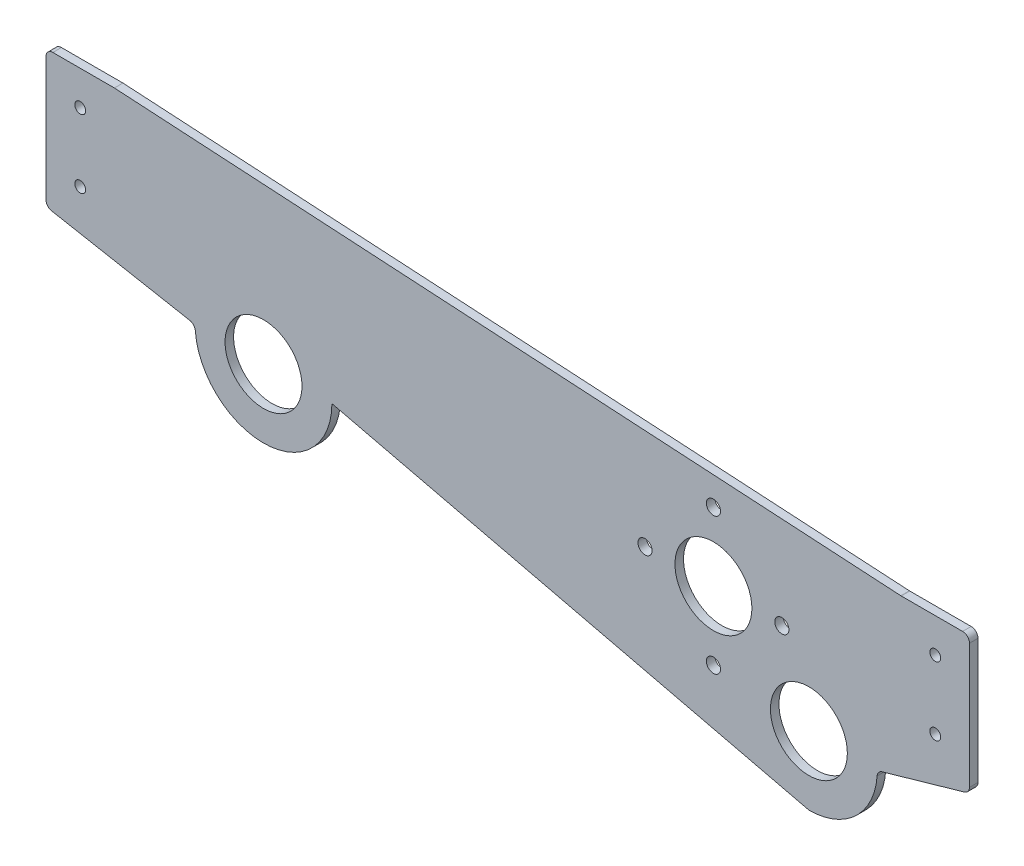
ISO-10303-21;
HEADER;
FILE_DESCRIPTION(('STEP AP214'),'2;1');
FILE_NAME('part.step','',(''),(''),'','','');
FILE_SCHEMA(('AUTOMOTIVE_DESIGN { 1 0 10303 214 1 1 1 1 }'));
ENDSEC;
DATA;
#1=APPLICATION_CONTEXT('core data for automotive mechanical design processes');
#2=APPLICATION_PROTOCOL_DEFINITION('international standard','automotive_design',2000,#1);
#3=PRODUCT_CONTEXT('',#1,'mechanical');
#4=PRODUCT('Part','Part','',(#3));
#5=PRODUCT_RELATED_PRODUCT_CATEGORY('part','',(#4));
#6=PRODUCT_DEFINITION_FORMATION('','',#4);
#7=PRODUCT_DEFINITION_CONTEXT('part definition',#1,'design');
#8=PRODUCT_DEFINITION('design','',#6,#7);
#9=PRODUCT_DEFINITION_SHAPE('','',#8);
#10=(LENGTH_UNIT() NAMED_UNIT(*) SI_UNIT(.MILLI.,.METRE.));
#11=(NAMED_UNIT(*) PLANE_ANGLE_UNIT() SI_UNIT($,.RADIAN.));
#12=(NAMED_UNIT(*) SI_UNIT($,.STERADIAN.) SOLID_ANGLE_UNIT());
#13=UNCERTAINTY_MEASURE_WITH_UNIT(LENGTH_MEASURE(1.E-05),#10,'distance_accuracy_value','');
#14=(GEOMETRIC_REPRESENTATION_CONTEXT(3) GLOBAL_UNCERTAINTY_ASSIGNED_CONTEXT((#13)) GLOBAL_UNIT_ASSIGNED_CONTEXT((#10,
#11,#12)) REPRESENTATION_CONTEXT('',''));
#15=CARTESIAN_POINT('',(0.,0.,0.));
#16=DIRECTION('',(0.,0.,1.));
#17=DIRECTION('',(1.,0.,0.));
#18=AXIS2_PLACEMENT_3D('',#15,#16,#17);
#19=CARTESIAN_POINT('',(-90.681416721827,103.131947821241,3.175));
#20=DIRECTION('',(0.,0.,-1.));
#21=DIRECTION('',(-1.,0.,0.));
#22=AXIS2_PLACEMENT_3D('',#19,#20,#21);
#23=CYLINDRICAL_SURFACE('',#22,25.4);
#24=CARTESIAN_POINT('',(-90.681416721827,103.131947821241,3.175));
#25=DIRECTION('',(0.,0.,1.));
#26=DIRECTION('',(1.,0.,0.));
#27=AXIS2_PLACEMENT_3D('',#24,#25,#26);
#28=CIRCLE('',#27,25.4);
#29=CARTESIAN_POINT('',(-116.007785817688,101.199325659454,3.175));
#30=VERTEX_POINT('',#29);
#31=CARTESIAN_POINT('',(-65.2814167218271,103.131947821241,3.175));
#32=VERTEX_POINT('',#31);
#33=EDGE_CURVE('E156',#30,#32,#28,.T.);
#34=ORIENTED_EDGE('',*,*,#33,.F.);
#35=DIRECTION('',(0.,0.,-1.));
#36=VECTOR('',#35,1.);
#37=CARTESIAN_POINT('',(-116.007785817688,101.199325659454,3.175));
#38=LINE('',#37,#36);
#39=CARTESIAN_POINT('',(-116.007785817688,101.199325659454,0.));
#40=VERTEX_POINT('',#39);
#41=EDGE_CURVE('E234',#30,#40,#38,.T.);
#42=ORIENTED_EDGE('',*,*,#41,.T.);
#43=CARTESIAN_POINT('',(-90.681416721827,103.131947821241,0.));
#44=DIRECTION('',(0.,0.,1.));
#45=DIRECTION('',(1.,0.,0.));
#46=AXIS2_PLACEMENT_3D('',#43,#44,#45);
#47=CIRCLE('',#46,25.4);
#48=CARTESIAN_POINT('',(-65.2814167218271,103.131947821241,0.));
#49=VERTEX_POINT('',#48);
#50=EDGE_CURVE('E181',#40,#49,#47,.T.);
#51=ORIENTED_EDGE('',*,*,#50,.T.);
#52=DIRECTION('',(0.,0.,-1.));
#53=VECTOR('',#52,1.);
#54=CARTESIAN_POINT('',(-65.2814167218271,103.131947821241,3.175));
#55=LINE('',#54,#53);
#56=EDGE_CURVE('E174',#32,#49,#55,.T.);
#57=ORIENTED_EDGE('',*,*,#56,.F.);
#58=EDGE_LOOP('',(#34,#42,#51,#57));
#59=FACE_BOUND('',#58,.T.);
#60=ADVANCED_FACE('F38',(#59),#23,.T.);
#61=CARTESIAN_POINT('',(19.7382826162339,82.8854057679976,3.175));
#62=DIRECTION('',(0.231661203092081,0.972796529075803,0.));
#63=DIRECTION('',(-0.972796529075803,0.231661203092081,0.));
#64=AXIS2_PLACEMENT_3D('',#61,#62,#63);
#65=PLANE('',#64);
#66=DIRECTION('',(0.972796529075803,-0.231661203092081,0.));
#67=VECTOR('',#66,1.);
#68=CARTESIAN_POINT('',(19.7382826162339,82.8854057679976,0.));
#69=LINE('',#68,#67);
#70=CARTESIAN_POINT('',(111.824894309563,60.9559532916229,0.));
#71=VERTEX_POINT('',#70);
#72=EDGE_CURVE('E341',#49,#71,#69,.T.);
#73=ORIENTED_EDGE('',*,*,#72,.T.);
#74=DIRECTION('',(0.,0.,-1.));
#75=VECTOR('',#74,1.);
#76=CARTESIAN_POINT('',(111.824894309563,60.9559532916229,3.175));
#77=LINE('',#76,#75);
#78=CARTESIAN_POINT('',(111.824894309563,60.9559532916229,3.175));
#79=VERTEX_POINT('',#78);
#80=EDGE_CURVE('E176',#79,#71,#77,.T.);
#81=ORIENTED_EDGE('',*,*,#80,.F.);
#82=DIRECTION('',(0.972796529075803,-0.231661203092081,0.));
#83=VECTOR('',#82,1.);
#84=CARTESIAN_POINT('',(19.7382826162339,82.8854057679976,3.175));
#85=LINE('',#84,#83);
#86=EDGE_CURVE('E162',#32,#79,#85,.T.);
#87=ORIENTED_EDGE('',*,*,#86,.F.);
#88=ORIENTED_EDGE('',*,*,#56,.T.);
#89=EDGE_LOOP('',(#73,#81,#87,#88));
#90=FACE_BOUND('',#89,.T.);
#91=ADVANCED_FACE('F173',(#90),#65,.F.);
#92=CARTESIAN_POINT('',(111.824894309563,86.3559532916229,3.175));
#93=DIRECTION('',(0.,0.,-1.));
#94=DIRECTION('',(-1.,0.,0.));
#95=AXIS2_PLACEMENT_3D('',#92,#93,#94);
#96=CYLINDRICAL_SURFACE('',#95,25.4);
#97=CARTESIAN_POINT('',(111.824894309563,86.3559532916229,0.));
#98=DIRECTION('',(0.,0.,1.));
#99=DIRECTION('',(1.,0.,0.));
#100=AXIS2_PLACEMENT_3D('',#97,#98,#99);
#101=CIRCLE('',#100,25.4);
#102=CARTESIAN_POINT('',(137.164009765819,84.5983333399428,0.));
#103=VERTEX_POINT('',#102);
#104=EDGE_CURVE('E344',#71,#103,#101,.T.);
#105=ORIENTED_EDGE('',*,*,#104,.T.);
#106=DIRECTION('',(0.,0.,-1.));
#107=VECTOR('',#106,1.);
#108=CARTESIAN_POINT('',(137.164009765819,84.5983333399428,3.175));
#109=LINE('',#108,#107);
#110=CARTESIAN_POINT('',(137.164009765819,84.5983333399428,3.175));
#111=VERTEX_POINT('',#110);
#112=EDGE_CURVE('E232',#103,#111,#109,.F.);
#113=ORIENTED_EDGE('',*,*,#112,.T.);
#114=CARTESIAN_POINT('',(111.824894309563,86.3559532916229,3.175));
#115=DIRECTION('',(0.,0.,1.));
#116=DIRECTION('',(1.,0.,0.));
#117=AXIS2_PLACEMENT_3D('',#114,#115,#116);
#118=CIRCLE('',#117,25.4);
#119=EDGE_CURVE('E178',#79,#111,#118,.T.);
#120=ORIENTED_EDGE('',*,*,#119,.F.);
#121=ORIENTED_EDGE('',*,*,#80,.T.);
#122=EDGE_LOOP('',(#105,#113,#120,#121));
#123=FACE_BOUND('',#122,.T.);
#124=ADVANCED_FACE('F272',(#123),#96,.T.);
#125=CARTESIAN_POINT('',(-12.4550081915659,43.4486341080888,3.175));
#126=DIRECTION('',(-0.27556197601449,0.961283307550375,0.));
#127=DIRECTION('',(-0.961283307550375,-0.27556197601449,0.));
#128=AXIS2_PLACEMENT_3D('',#125,#126,#127);
#129=PLANE('',#128);
#130=DIRECTION('',(0.961283307550375,0.27556197601449,0.));
#131=VECTOR('',#130,1.);
#132=CARTESIAN_POINT('',(-12.4550081915659,43.4486341080888,0.));
#133=LINE('',#132,#131);
#134=CARTESIAN_POINT('',(138.997993892368,86.8642309459527,0.));
#135=VERTEX_POINT('',#134);
#136=CARTESIAN_POINT('',(169.609927419077,95.6394638309803,0.));
#137=VERTEX_POINT('',#136);
#138=EDGE_CURVE('E347',#135,#137,#133,.T.);
#139=ORIENTED_EDGE('',*,*,#138,.T.);
#140=DIRECTION('',(0.,0.,-1.));
#141=VECTOR('',#140,1.);
#142=CARTESIAN_POINT('',(169.609927419077,95.6394638309803,3.175));
#143=LINE('',#142,#141);
#144=CARTESIAN_POINT('',(169.609927419077,95.6394638309803,3.175));
#145=VERTEX_POINT('',#144);
#146=EDGE_CURVE('E223',#137,#145,#143,.F.);
#147=ORIENTED_EDGE('',*,*,#146,.T.);
#148=DIRECTION('',(0.961283307550375,0.27556197601449,0.));
#149=VECTOR('',#148,1.);
#150=CARTESIAN_POINT('',(-12.4550081915659,43.4486341080888,3.175));
#151=LINE('',#150,#149);
#152=CARTESIAN_POINT('',(138.997993892368,86.8642309459527,3.175));
#153=VERTEX_POINT('',#152);
#154=EDGE_CURVE('E424',#153,#145,#151,.T.);
#155=ORIENTED_EDGE('',*,*,#154,.F.);
#156=DIRECTION('',(0.,0.,1.));
#157=VECTOR('',#156,1.);
#158=CARTESIAN_POINT('',(138.997993892368,86.8642309459527,0.));
#159=LINE('',#158,#157);
#160=EDGE_CURVE('E220',#153,#135,#159,.F.);
#161=ORIENTED_EDGE('',*,*,#160,.T.);
#162=EDGE_LOOP('',(#139,#147,#155,#161));
#163=FACE_BOUND('',#162,.T.);
#164=ADVANCED_FACE('F410',(#163),#129,.F.);
#165=CARTESIAN_POINT('',(171.45,0.,3.175));
#166=DIRECTION('',(-1.,0.,0.));
#167=DIRECTION('',(0.,0.,1.));
#168=AXIS2_PLACEMENT_3D('',#165,#166,#167);
#169=PLANE('',#168);
#170=DIRECTION('',(0.,1.,0.));
#171=VECTOR('',#170,1.);
#172=CARTESIAN_POINT('',(171.45,0.,0.));
#173=LINE('',#172,#171);
#174=CARTESIAN_POINT('',(171.45,98.0811234321583,0.));
#175=VERTEX_POINT('',#174);
#176=CARTESIAN_POINT('',(171.45,144.42694,0.));
#177=VERTEX_POINT('',#176);
#178=EDGE_CURVE('E350',#175,#177,#173,.T.);
#179=ORIENTED_EDGE('',*,*,#178,.T.);
#180=DIRECTION('',(0.,0.,-1.));
#181=VECTOR('',#180,1.);
#182=CARTESIAN_POINT('',(171.45,144.42694,3.175));
#183=LINE('',#182,#181);
#184=CARTESIAN_POINT('',(171.45,144.42694,3.175));
#185=VERTEX_POINT('',#184);
#186=EDGE_CURVE('E218',#177,#185,#183,.F.);
#187=ORIENTED_EDGE('',*,*,#186,.T.);
#188=DIRECTION('',(0.,1.,0.));
#189=VECTOR('',#188,1.);
#190=CARTESIAN_POINT('',(171.45,0.,3.175));
#191=LINE('',#190,#189);
#192=CARTESIAN_POINT('',(171.45,98.0811234321583,3.175));
#193=VERTEX_POINT('',#192);
#194=EDGE_CURVE('E314',#193,#185,#191,.T.);
#195=ORIENTED_EDGE('',*,*,#194,.F.);
#196=DIRECTION('',(0.,0.,-1.));
#197=VECTOR('',#196,1.);
#198=CARTESIAN_POINT('',(171.45,98.0811234321583,3.175));
#199=LINE('',#198,#197);
#200=EDGE_CURVE('E215',#193,#175,#199,.T.);
#201=ORIENTED_EDGE('',*,*,#200,.T.);
#202=EDGE_LOOP('',(#179,#187,#195,#201));
#203=FACE_BOUND('',#202,.T.);
#204=ADVANCED_FACE('F406',(#203),#169,.F.);
#205=CARTESIAN_POINT('',(0.,146.96694,3.175));
#206=DIRECTION('',(0.,1.,0.));
#207=DIRECTION('',(0.,0.,1.));
#208=AXIS2_PLACEMENT_3D('',#205,#206,#207);
#209=PLANE('',#208);
#210=DIRECTION('',(1.,0.,0.));
#211=VECTOR('',#210,1.);
#212=CARTESIAN_POINT('',(0.,146.96694,3.175));
#213=LINE('',#212,#211);
#214=CARTESIAN_POINT('',(146.125030125413,146.96694,3.175));
#215=VERTEX_POINT('',#214);
#216=CARTESIAN_POINT('',(168.91,146.96694,3.175));
#217=VERTEX_POINT('',#216);
#218=EDGE_CURVE('E304',#215,#217,#213,.T.);
#219=ORIENTED_EDGE('',*,*,#218,.T.);
#220=DIRECTION('',(0.,0.,-1.));
#221=VECTOR('',#220,1.);
#222=CARTESIAN_POINT('',(168.91,146.96694,0.));
#223=LINE('',#222,#221);
#224=CARTESIAN_POINT('',(168.91,146.96694,0.));
#225=VERTEX_POINT('',#224);
#226=EDGE_CURVE('E212',#217,#225,#223,.T.);
#227=ORIENTED_EDGE('',*,*,#226,.T.);
#228=DIRECTION('',(1.,0.,0.));
#229=VECTOR('',#228,1.);
#230=CARTESIAN_POINT('',(0.,146.96694,0.));
#231=LINE('',#230,#229);
#232=CARTESIAN_POINT('',(146.125030125413,146.96694,0.));
#233=VERTEX_POINT('',#232);
#234=EDGE_CURVE('E353',#233,#225,#231,.T.);
#235=ORIENTED_EDGE('',*,*,#234,.F.);
#236=DIRECTION('',(0.,0.,-1.));
#237=VECTOR('',#236,1.);
#238=CARTESIAN_POINT('',(146.125030125413,146.96694,3.175));
#239=LINE('',#238,#237);
#240=EDGE_CURVE('E210',#233,#215,#239,.F.);
#241=ORIENTED_EDGE('',*,*,#240,.T.);
#242=EDGE_LOOP('',(#219,#227,#235,#241));
#243=FACE_BOUND('',#242,.T.);
#244=ADVANCED_FACE('F403',(#243),#209,.T.);
#245=CARTESIAN_POINT('',(9.16881158655861,155.060784184447,3.175));
#246=DIRECTION('',(0.0590273329964298,0.998256366851386,0.));
#247=DIRECTION('',(-0.998256366851386,0.0590273329964298,0.));
#248=AXIS2_PLACEMENT_3D('',#245,#246,#247);
#249=PLANE('',#248);
#250=DIRECTION('',(0.998256366851386,-0.0590273329964298,0.));
#251=VECTOR('',#250,1.);
#252=CARTESIAN_POINT('',(9.16881158655861,155.060784184447,3.175));
#253=LINE('',#252,#251);
#254=CARTESIAN_POINT('',(-146.05,164.23894,3.175));
#255=VERTEX_POINT('',#254);
#256=CARTESIAN_POINT('',(145.975100699602,146.971368828197,3.175));
#257=VERTEX_POINT('',#256);
#258=EDGE_CURVE('E302',#255,#257,#253,.T.);
#259=ORIENTED_EDGE('',*,*,#258,.T.);
#260=DIRECTION('',(0.,0.,-1.));
#261=VECTOR('',#260,1.);
#262=CARTESIAN_POINT('',(145.975100699602,146.971368828197,0.));
#263=LINE('',#262,#261);
#264=CARTESIAN_POINT('',(145.975100699602,146.971368828197,0.));
#265=VERTEX_POINT('',#264);
#266=EDGE_CURVE('E229',#257,#265,#263,.T.);
#267=ORIENTED_EDGE('',*,*,#266,.T.);
#268=DIRECTION('',(0.998256366851386,-0.0590273329964298,0.));
#269=VECTOR('',#268,1.);
#270=CARTESIAN_POINT('',(9.16881158655861,155.060784184447,0.));
#271=LINE('',#270,#269);
#272=CARTESIAN_POINT('',(-146.05,164.23894,0.));
#273=VERTEX_POINT('',#272);
#274=EDGE_CURVE('E356',#273,#265,#271,.T.);
#275=ORIENTED_EDGE('',*,*,#274,.F.);
#276=DIRECTION('',(0.,0.,-1.));
#277=VECTOR('',#276,1.);
#278=CARTESIAN_POINT('',(-146.05,164.23894,3.175));
#279=LINE('',#278,#277);
#280=EDGE_CURVE('E187',#255,#273,#279,.T.);
#281=ORIENTED_EDGE('',*,*,#280,.F.);
#282=EDGE_LOOP('',(#259,#267,#275,#281));
#283=FACE_BOUND('',#282,.T.);
#284=ADVANCED_FACE('F306',(#283),#249,.T.);
#285=CARTESIAN_POINT('',(0.,164.23894,3.175));
#286=DIRECTION('',(0.,-1.,0.));
#287=DIRECTION('',(0.,0.,-1.));
#288=AXIS2_PLACEMENT_3D('',#285,#286,#287);
#289=PLANE('',#288);
#290=DIRECTION('',(-1.,0.,0.));
#291=VECTOR('',#290,1.);
#292=CARTESIAN_POINT('',(0.,164.23894,0.));
#293=LINE('',#292,#291);
#294=CARTESIAN_POINT('',(-168.91,164.23894,0.));
#295=VERTEX_POINT('',#294);
#296=EDGE_CURVE('E358',#273,#295,#293,.T.);
#297=ORIENTED_EDGE('',*,*,#296,.T.);
#298=DIRECTION('',(0.,0.,-1.));
#299=VECTOR('',#298,1.);
#300=CARTESIAN_POINT('',(-168.91,164.23894,3.175));
#301=LINE('',#300,#299);
#302=CARTESIAN_POINT('',(-168.91,164.23894,3.175));
#303=VERTEX_POINT('',#302);
#304=EDGE_CURVE('E201',#295,#303,#301,.F.);
#305=ORIENTED_EDGE('',*,*,#304,.T.);
#306=DIRECTION('',(-1.,0.,0.));
#307=VECTOR('',#306,1.);
#308=CARTESIAN_POINT('',(0.,164.23894,3.175));
#309=LINE('',#308,#307);
#310=EDGE_CURVE('E310',#255,#303,#309,.T.);
#311=ORIENTED_EDGE('',*,*,#310,.F.);
#312=ORIENTED_EDGE('',*,*,#280,.T.);
#313=EDGE_LOOP('',(#297,#305,#311,#312));
#314=FACE_BOUND('',#313,.T.);
#315=ADVANCED_FACE('F379',(#314),#289,.F.);
#316=CARTESIAN_POINT('',(-171.45,0.,3.175));
#317=DIRECTION('',(-1.,0.,0.));
#318=DIRECTION('',(0.,0.,1.));
#319=AXIS2_PLACEMENT_3D('',#316,#317,#318);
#320=PLANE('',#319);
#321=DIRECTION('',(0.,1.,0.));
#322=VECTOR('',#321,1.);
#323=CARTESIAN_POINT('',(-171.45,0.,3.175));
#324=LINE('',#323,#322);
#325=CARTESIAN_POINT('',(-171.45,115.549747155126,3.175));
#326=VERTEX_POINT('',#325);
#327=CARTESIAN_POINT('',(-171.45,161.69894,3.175));
#328=VERTEX_POINT('',#327);
#329=EDGE_CURVE('E312',#326,#328,#324,.T.);
#330=ORIENTED_EDGE('',*,*,#329,.T.);
#331=DIRECTION('',(0.,0.,-1.));
#332=VECTOR('',#331,1.);
#333=CARTESIAN_POINT('',(-171.45,161.69894,0.));
#334=LINE('',#333,#332);
#335=CARTESIAN_POINT('',(-171.45,161.69894,0.));
#336=VERTEX_POINT('',#335);
#337=EDGE_CURVE('E185',#328,#336,#334,.T.);
#338=ORIENTED_EDGE('',*,*,#337,.T.);
#339=DIRECTION('',(0.,1.,0.));
#340=VECTOR('',#339,1.);
#341=CARTESIAN_POINT('',(-171.45,0.,0.));
#342=LINE('',#341,#340);
#343=CARTESIAN_POINT('',(-171.45,115.549747155126,0.));
#344=VERTEX_POINT('',#343);
#345=EDGE_CURVE('E253',#344,#336,#342,.T.);
#346=ORIENTED_EDGE('',*,*,#345,.F.);
#347=DIRECTION('',(0.,0.,-1.));
#348=VECTOR('',#347,1.);
#349=CARTESIAN_POINT('',(-171.45,115.549747155126,3.175));
#350=LINE('',#349,#348);
#351=EDGE_CURVE('E183',#344,#326,#350,.F.);
#352=ORIENTED_EDGE('',*,*,#351,.T.);
#353=EDGE_LOOP('',(#330,#338,#346,#352));
#354=FACE_BOUND('',#353,.T.);
#355=ADVANCED_FACE('F385',(#354),#320,.T.);
#356=CARTESIAN_POINT('',(158.75,108.86694,3.175));
#357=DIRECTION('',(0.,0.,-1.));
#358=DIRECTION('',(-1.,0.,0.));
#359=AXIS2_PLACEMENT_3D('',#356,#357,#358);
#360=CYLINDRICAL_SURFACE('',#359,2.01930000000001);
#361=CARTESIAN_POINT('',(158.75,108.86694,3.175));
#362=DIRECTION('',(0.,0.,1.));
#363=DIRECTION('',(1.,0.,0.));
#364=AXIS2_PLACEMENT_3D('',#361,#362,#363);
#365=CIRCLE('',#364,2.01930000000001);
#366=CARTESIAN_POINT('',(160.7693,108.86694,3.175));
#367=VERTEX_POINT('',#366);
#368=EDGE_CURVE('E334',#367,#367,#365,.T.);
#369=ORIENTED_EDGE('',*,*,#368,.T.);
#370=EDGE_LOOP('',(#369));
#371=FACE_BOUND('',#370,.T.);
#372=CARTESIAN_POINT('',(158.75,108.86694,0.));
#373=DIRECTION('',(0.,0.,1.));
#374=DIRECTION('',(1.,0.,0.));
#375=AXIS2_PLACEMENT_3D('',#372,#373,#374);
#376=CIRCLE('',#375,2.01930000000001);
#377=CARTESIAN_POINT('',(160.7693,108.86694,0.));
#378=VERTEX_POINT('',#377);
#379=EDGE_CURVE('E373',#378,#378,#376,.T.);
#380=ORIENTED_EDGE('',*,*,#379,.F.);
#381=EDGE_LOOP('',(#380));
#382=FACE_BOUND('',#381,.T.);
#383=ADVANCED_FACE('F388',(#371,#382),#360,.F.);
#384=CARTESIAN_POINT('',(158.75,134.26694,3.175));
#385=DIRECTION('',(0.,0.,-1.));
#386=DIRECTION('',(-1.,0.,0.));
#387=AXIS2_PLACEMENT_3D('',#384,#385,#386);
#388=CYLINDRICAL_SURFACE('',#387,2.0193);
#389=CARTESIAN_POINT('',(158.75,134.26694,3.175));
#390=DIRECTION('',(0.,0.,1.));
#391=DIRECTION('',(1.,0.,0.));
#392=AXIS2_PLACEMENT_3D('',#389,#390,#391);
#393=CIRCLE('',#392,2.0193);
#394=CARTESIAN_POINT('',(160.7693,134.26694,3.175));
#395=VERTEX_POINT('',#394);
#396=EDGE_CURVE('E331',#395,#395,#393,.T.);
#397=ORIENTED_EDGE('',*,*,#396,.T.);
#398=EDGE_LOOP('',(#397));
#399=FACE_BOUND('',#398,.T.);
#400=CARTESIAN_POINT('',(158.75,134.26694,0.));
#401=DIRECTION('',(0.,0.,1.));
#402=DIRECTION('',(1.,0.,0.));
#403=AXIS2_PLACEMENT_3D('',#400,#401,#402);
#404=CIRCLE('',#403,2.0193);
#405=CARTESIAN_POINT('',(160.7693,134.26694,0.));
#406=VERTEX_POINT('',#405);
#407=EDGE_CURVE('E370',#406,#406,#404,.T.);
#408=ORIENTED_EDGE('',*,*,#407,.F.);
#409=EDGE_LOOP('',(#408));
#410=FACE_BOUND('',#409,.T.);
#411=ADVANCED_FACE('F394',(#399,#410),#388,.F.);
#412=CARTESIAN_POINT('',(-158.75,151.53894,3.175));
#413=DIRECTION('',(0.,0.,-1.));
#414=DIRECTION('',(-1.,0.,0.));
#415=AXIS2_PLACEMENT_3D('',#412,#413,#414);
#416=CYLINDRICAL_SURFACE('',#415,2.0193);
#417=CARTESIAN_POINT('',(-158.75,151.53894,3.175));
#418=DIRECTION('',(0.,0.,1.));
#419=DIRECTION('',(1.,0.,0.));
#420=AXIS2_PLACEMENT_3D('',#417,#418,#419);
#421=CIRCLE('',#420,2.0193);
#422=CARTESIAN_POINT('',(-156.7307,151.53894,3.175));
#423=VERTEX_POINT('',#422);
#424=EDGE_CURVE('E328',#423,#423,#421,.T.);
#425=ORIENTED_EDGE('',*,*,#424,.T.);
#426=EDGE_LOOP('',(#425));
#427=FACE_BOUND('',#426,.T.);
#428=CARTESIAN_POINT('',(-158.75,151.53894,0.));
#429=DIRECTION('',(0.,0.,1.));
#430=DIRECTION('',(1.,0.,0.));
#431=AXIS2_PLACEMENT_3D('',#428,#429,#430);
#432=CIRCLE('',#431,2.0193);
#433=CARTESIAN_POINT('',(-156.7307,151.53894,0.));
#434=VERTEX_POINT('',#433);
#435=EDGE_CURVE('E367',#434,#434,#432,.T.);
#436=ORIENTED_EDGE('',*,*,#435,.F.);
#437=EDGE_LOOP('',(#436));
#438=FACE_BOUND('',#437,.T.);
#439=ADVANCED_FACE('F503',(#427,#438),#416,.F.);
#440=CARTESIAN_POINT('',(111.824894309563,86.3559532916229,3.175));
#441=DIRECTION('',(0.,0.,-1.));
#442=DIRECTION('',(-1.,0.,0.));
#443=AXIS2_PLACEMENT_3D('',#440,#441,#442);
#444=CYLINDRICAL_SURFACE('',#443,14.2875);
#445=CARTESIAN_POINT('',(111.824894309563,86.3559532916229,3.175));
#446=DIRECTION('',(0.,0.,1.));
#447=DIRECTION('',(1.,0.,0.));
#448=AXIS2_PLACEMENT_3D('',#445,#446,#447);
#449=CIRCLE('',#448,14.2875);
#450=CARTESIAN_POINT('',(126.112394309563,86.3559532916229,3.175));
#451=VERTEX_POINT('',#450);
#452=EDGE_CURVE('E325',#451,#451,#449,.T.);
#453=ORIENTED_EDGE('',*,*,#452,.T.);
#454=EDGE_LOOP('',(#453));
#455=FACE_BOUND('',#454,.T.);
#456=CARTESIAN_POINT('',(111.824894309563,86.3559532916229,0.));
#457=DIRECTION('',(0.,0.,1.));
#458=DIRECTION('',(1.,0.,0.));
#459=AXIS2_PLACEMENT_3D('',#456,#457,#458);
#460=CIRCLE('',#459,14.2875);
#461=CARTESIAN_POINT('',(126.112394309563,86.3559532916229,0.));
#462=VERTEX_POINT('',#461);
#463=EDGE_CURVE('E364',#462,#462,#460,.T.);
#464=ORIENTED_EDGE('',*,*,#463,.F.);
#465=EDGE_LOOP('',(#464));
#466=FACE_BOUND('',#465,.T.);
#467=ADVANCED_FACE('F507',(#455,#466),#444,.F.);
#468=CARTESIAN_POINT('',(-90.681416721827,103.131947821241,3.175));
#469=DIRECTION('',(0.,0.,-1.));
#470=DIRECTION('',(-1.,0.,0.));
#471=AXIS2_PLACEMENT_3D('',#468,#469,#470);
#472=CYLINDRICAL_SURFACE('',#471,14.2875);
#473=CARTESIAN_POINT('',(-90.681416721827,103.131947821241,3.175));
#474=DIRECTION('',(0.,0.,1.));
#475=DIRECTION('',(1.,0.,0.));
#476=AXIS2_PLACEMENT_3D('',#473,#474,#475);
#477=CIRCLE('',#476,14.2875);
#478=CARTESIAN_POINT('',(-76.393916721827,103.131947821241,3.175));
#479=VERTEX_POINT('',#478);
#480=EDGE_CURVE('E322',#479,#479,#477,.T.);
#481=ORIENTED_EDGE('',*,*,#480,.T.);
#482=EDGE_LOOP('',(#481));
#483=FACE_BOUND('',#482,.T.);
#484=CARTESIAN_POINT('',(-90.681416721827,103.131947821241,0.));
#485=DIRECTION('',(0.,0.,1.));
#486=DIRECTION('',(1.,0.,0.));
#487=AXIS2_PLACEMENT_3D('',#484,#485,#486);
#488=CIRCLE('',#487,14.2875);
#489=CARTESIAN_POINT('',(-76.393916721827,103.131947821241,0.));
#490=VERTEX_POINT('',#489);
#491=EDGE_CURVE('E252',#490,#490,#488,.T.);
#492=ORIENTED_EDGE('',*,*,#491,.F.);
#493=EDGE_LOOP('',(#492));
#494=FACE_BOUND('',#493,.T.);
#495=ADVANCED_FACE('F510',(#483,#494),#472,.F.);
#496=CARTESIAN_POINT('',(14.6674536846778,78.7927376613752,3.175));
#497=DIRECTION('',(0.183008489971372,0.983111332758604,0.));
#498=DIRECTION('',(-0.983111332758604,0.183008489971372,0.));
#499=AXIS2_PLACEMENT_3D('',#496,#497,#498);
#500=PLANE('',#499);
#501=DIRECTION('',(0.983111332758604,-0.183008489971372,0.));
#502=VECTOR('',#501,1.);
#503=CARTESIAN_POINT('',(14.6674536846778,78.7927376613752,3.175));
#504=LINE('',#503,#502);
#505=CARTESIAN_POINT('',(-169.374841564527,113.05264436992,3.175));
#506=VERTEX_POINT('',#505);
#507=CARTESIAN_POINT('',(-118.075581162747,103.503166228482,3.175));
#508=VERTEX_POINT('',#507);
#509=EDGE_CURVE('E320',#506,#508,#504,.T.);
#510=ORIENTED_EDGE('',*,*,#509,.F.);
#511=DIRECTION('',(0.,0.,-1.));
#512=VECTOR('',#511,1.);
#513=CARTESIAN_POINT('',(-169.374841564527,113.05264436992,0.));
#514=LINE('',#513,#512);
#515=CARTESIAN_POINT('',(-169.374841564527,113.05264436992,0.));
#516=VERTEX_POINT('',#515);
#517=EDGE_CURVE('E226',#506,#516,#514,.T.);
#518=ORIENTED_EDGE('',*,*,#517,.T.);
#519=DIRECTION('',(0.983111332758604,-0.183008489971372,0.));
#520=VECTOR('',#519,1.);
#521=CARTESIAN_POINT('',(14.6674536846778,78.7927376613752,0.));
#522=LINE('',#521,#520);
#523=CARTESIAN_POINT('',(-118.075581162747,103.503166228482,0.));
#524=VERTEX_POINT('',#523);
#525=EDGE_CURVE('E248',#516,#524,#522,.T.);
#526=ORIENTED_EDGE('',*,*,#525,.T.);
#527=DIRECTION('',(0.,0.,1.));
#528=VECTOR('',#527,1.);
#529=CARTESIAN_POINT('',(-118.075581162747,103.503166228482,3.175));
#530=LINE('',#529,#528);
#531=EDGE_CURVE('E53',#524,#508,#530,.T.);
#532=ORIENTED_EDGE('',*,*,#531,.T.);
#533=EDGE_LOOP('',(#510,#518,#526,#532));
#534=FACE_BOUND('',#533,.T.);
#535=ADVANCED_FACE('F250',(#534),#500,.F.);
#536=CARTESIAN_POINT('',(-158.75,126.13894,3.175));
#537=DIRECTION('',(0.,0.,-1.));
#538=DIRECTION('',(-1.,0.,0.));
#539=AXIS2_PLACEMENT_3D('',#536,#537,#538);
#540=CYLINDRICAL_SURFACE('',#539,2.0193);
#541=CARTESIAN_POINT('',(-158.75,126.13894,3.175));
#542=DIRECTION('',(0.,0.,1.));
#543=DIRECTION('',(1.,0.,0.));
#544=AXIS2_PLACEMENT_3D('',#541,#542,#543);
#545=CIRCLE('',#544,2.0193);
#546=CARTESIAN_POINT('',(-156.7307,126.13894,3.175));
#547=VERTEX_POINT('',#546);
#548=EDGE_CURVE('E337',#547,#547,#545,.T.);
#549=ORIENTED_EDGE('',*,*,#548,.T.);
#550=EDGE_LOOP('',(#549));
#551=FACE_BOUND('',#550,.T.);
#552=CARTESIAN_POINT('',(-158.75,126.13894,0.));
#553=DIRECTION('',(0.,0.,1.));
#554=DIRECTION('',(1.,0.,0.));
#555=AXIS2_PLACEMENT_3D('',#552,#553,#554);
#556=CIRCLE('',#555,2.0193);
#557=CARTESIAN_POINT('',(-156.7307,126.13894,0.));
#558=VERTEX_POINT('',#557);
#559=EDGE_CURVE('E169',#558,#558,#556,.T.);
#560=ORIENTED_EDGE('',*,*,#559,.F.);
#561=EDGE_LOOP('',(#560));
#562=FACE_BOUND('',#561,.T.);
#563=ADVANCED_FACE('F473',(#551,#562),#540,.F.);
#564=CARTESIAN_POINT('',(0.,0.,3.175));
#565=DIRECTION('',(0.,0.,1.));
#566=DIRECTION('',(1.,0.,0.));
#567=AXIS2_PLACEMENT_3D('',#564,#565,#566);
#568=PLANE('',#567);
#569=CARTESIAN_POINT('',(76.3807095821955,140.635499150452,3.175));
#570=DIRECTION('',(0.,0.,1.));
#571=DIRECTION('',(1.,0.,0.));
#572=AXIS2_PLACEMENT_3D('',#569,#570,#571);
#573=CIRCLE('',#572,2.62890000000001);
#574=CARTESIAN_POINT('',(79.0096095821955,140.635499150452,3.175));
#575=VERTEX_POINT('',#574);
#576=EDGE_CURVE('E445',#575,#575,#573,.T.);
#577=ORIENTED_EDGE('',*,*,#576,.F.);
#578=EDGE_LOOP('',(#577));
#579=FACE_BOUND('',#578,.T.);
#580=CARTESIAN_POINT('',(101.780709582196,115.235499150452,3.175));
#581=DIRECTION('',(0.,0.,1.));
#582=DIRECTION('',(1.,0.,0.));
#583=AXIS2_PLACEMENT_3D('',#580,#581,#582);
#584=CIRCLE('',#583,2.62890000000002);
#585=CARTESIAN_POINT('',(104.409609582196,115.235499150452,3.175));
#586=VERTEX_POINT('',#585);
#587=EDGE_CURVE('E438',#586,#586,#584,.T.);
#588=ORIENTED_EDGE('',*,*,#587,.F.);
#589=EDGE_LOOP('',(#588));
#590=FACE_BOUND('',#589,.T.);
#591=CARTESIAN_POINT('',(76.380709582196,89.8354991504521,3.175));
#592=DIRECTION('',(0.,0.,1.));
#593=DIRECTION('',(1.,0.,0.));
#594=AXIS2_PLACEMENT_3D('',#591,#592,#593);
#595=CIRCLE('',#594,2.6289);
#596=CARTESIAN_POINT('',(79.009609582196,89.8354991504521,3.175));
#597=VERTEX_POINT('',#596);
#598=EDGE_CURVE('E456',#597,#597,#595,.T.);
#599=ORIENTED_EDGE('',*,*,#598,.F.);
#600=EDGE_LOOP('',(#599));
#601=FACE_BOUND('',#600,.T.);
#602=CARTESIAN_POINT('',(50.9807095821958,115.235499150452,3.175));
#603=DIRECTION('',(0.,0.,1.));
#604=DIRECTION('',(1.,0.,0.));
#605=AXIS2_PLACEMENT_3D('',#602,#603,#604);
#606=CIRCLE('',#605,2.62890000000001);
#607=CARTESIAN_POINT('',(53.6096095821958,115.235499150452,3.175));
#608=VERTEX_POINT('',#607);
#609=EDGE_CURVE('E450',#608,#608,#606,.T.);
#610=ORIENTED_EDGE('',*,*,#609,.F.);
#611=EDGE_LOOP('',(#610));
#612=FACE_BOUND('',#611,.T.);
#613=CARTESIAN_POINT('',(76.3807095821955,115.235499150452,3.175));
#614=DIRECTION('',(0.,0.,1.));
#615=DIRECTION('',(1.,0.,0.));
#616=AXIS2_PLACEMENT_3D('',#613,#614,#615);
#617=CIRCLE('',#616,14.2875);
#618=CARTESIAN_POINT('',(90.6682095821954,115.235499150452,3.175));
#619=VERTEX_POINT('',#618);
#620=EDGE_CURVE('E432',#619,#619,#617,.T.);
#621=ORIENTED_EDGE('',*,*,#620,.F.);
#622=EDGE_LOOP('',(#621));
#623=FACE_BOUND('',#622,.T.);
#624=ORIENTED_EDGE('',*,*,#310,.T.);
#625=CARTESIAN_POINT('',(-168.91,161.69894,3.175));
#626=DIRECTION('',(0.,0.,1.));
#627=DIRECTION('',(1.,0.,0.));
#628=AXIS2_PLACEMENT_3D('',#625,#626,#627);
#629=CIRCLE('',#628,2.54);
#630=EDGE_CURVE('E208',#303,#328,#629,.T.);
#631=ORIENTED_EDGE('',*,*,#630,.T.);
#632=ORIENTED_EDGE('',*,*,#329,.F.);
#633=CARTESIAN_POINT('',(-168.91,115.549747155126,3.175));
#634=DIRECTION('',(0.,0.,1.));
#635=DIRECTION('',(1.,0.,0.));
#636=AXIS2_PLACEMENT_3D('',#633,#634,#635);
#637=CIRCLE('',#636,2.54);
#638=EDGE_CURVE('E60',#326,#506,#637,.T.);
#639=ORIENTED_EDGE('',*,*,#638,.T.);
#640=ORIENTED_EDGE('',*,*,#509,.T.);
#641=CARTESIAN_POINT('',(-118.540422727274,101.006063443275,3.175));
#642=DIRECTION('',(0.,0.,1.));
#643=DIRECTION('',(1.,0.,0.));
#644=AXIS2_PLACEMENT_3D('',#641,#642,#643);
#645=CIRCLE('',#644,2.54);
#646=EDGE_CURVE('E11',#508,#30,#645,.F.);
#647=ORIENTED_EDGE('',*,*,#646,.T.);
#648=ORIENTED_EDGE('',*,*,#33,.T.);
#649=ORIENTED_EDGE('',*,*,#86,.T.);
#650=ORIENTED_EDGE('',*,*,#119,.T.);
#651=CARTESIAN_POINT('',(139.697921311445,84.4225713447748,3.175));
#652=DIRECTION('',(0.,0.,1.));
#653=DIRECTION('',(1.,0.,0.));
#654=AXIS2_PLACEMENT_3D('',#651,#652,#653);
#655=CIRCLE('',#654,2.54);
#656=EDGE_CURVE('E242',#111,#153,#655,.F.);
#657=ORIENTED_EDGE('',*,*,#656,.T.);
#658=ORIENTED_EDGE('',*,*,#154,.T.);
#659=CARTESIAN_POINT('',(168.91,98.0811234321583,3.175));
#660=DIRECTION('',(0.,0.,1.));
#661=DIRECTION('',(1.,0.,0.));
#662=AXIS2_PLACEMENT_3D('',#659,#660,#661);
#663=CIRCLE('',#662,2.54);
#664=EDGE_CURVE('E204',#145,#193,#663,.T.);
#665=ORIENTED_EDGE('',*,*,#664,.T.);
#666=ORIENTED_EDGE('',*,*,#194,.T.);
#667=CARTESIAN_POINT('',(168.91,144.42694,3.175));
#668=DIRECTION('',(0.,0.,1.));
#669=DIRECTION('',(1.,0.,0.));
#670=AXIS2_PLACEMENT_3D('',#667,#668,#669);
#671=CIRCLE('',#670,2.54);
#672=EDGE_CURVE('E206',#185,#217,#671,.T.);
#673=ORIENTED_EDGE('',*,*,#672,.T.);
#674=ORIENTED_EDGE('',*,*,#218,.F.);
#675=CARTESIAN_POINT('',(146.125030125413,149.50694,3.175));
#676=DIRECTION('',(0.,0.,1.));
#677=DIRECTION('',(1.,0.,0.));
#678=AXIS2_PLACEMENT_3D('',#675,#676,#677);
#679=CIRCLE('',#678,2.54);
#680=EDGE_CURVE('E238',#215,#257,#679,.F.);
#681=ORIENTED_EDGE('',*,*,#680,.T.);
#682=ORIENTED_EDGE('',*,*,#258,.F.);
#683=EDGE_LOOP('',(#624,#631,#632,#639,#640,#647,#648,#649,#650,#657,#658,#665,#666,#673,#674,
#681,#682));
#684=FACE_BOUND('',#683,.T.);
#685=ORIENTED_EDGE('',*,*,#480,.F.);
#686=EDGE_LOOP('',(#685));
#687=FACE_BOUND('',#686,.T.);
#688=ORIENTED_EDGE('',*,*,#452,.F.);
#689=EDGE_LOOP('',(#688));
#690=FACE_BOUND('',#689,.T.);
#691=ORIENTED_EDGE('',*,*,#424,.F.);
#692=EDGE_LOOP('',(#691));
#693=FACE_BOUND('',#692,.T.);
#694=ORIENTED_EDGE('',*,*,#396,.F.);
#695=EDGE_LOOP('',(#694));
#696=FACE_BOUND('',#695,.T.);
#697=ORIENTED_EDGE('',*,*,#368,.F.);
#698=EDGE_LOOP('',(#697));
#699=FACE_BOUND('',#698,.T.);
#700=ORIENTED_EDGE('',*,*,#548,.F.);
#701=EDGE_LOOP('',(#700));
#702=FACE_BOUND('',#701,.T.);
#703=ADVANCED_FACE('F159',(#579,#590,#601,#612,#623,#684,#687,#690,#693,#696,#699,#702),#568,.T.);
#704=CARTESIAN_POINT('',(0.,0.,0.));
#705=DIRECTION('',(0.,0.,1.));
#706=DIRECTION('',(1.,0.,0.));
#707=AXIS2_PLACEMENT_3D('',#704,#705,#706);
#708=PLANE('',#707);
#709=CARTESIAN_POINT('',(76.3807095821955,140.635499150452,0.));
#710=DIRECTION('',(0.,0.,1.));
#711=DIRECTION('',(1.,0.,0.));
#712=AXIS2_PLACEMENT_3D('',#709,#710,#711);
#713=CIRCLE('',#712,2.62890000000001);
#714=CARTESIAN_POINT('',(79.0096095821955,140.635499150452,0.));
#715=VERTEX_POINT('',#714);
#716=EDGE_CURVE('E435',#715,#715,#713,.T.);
#717=ORIENTED_EDGE('',*,*,#716,.T.);
#718=EDGE_LOOP('',(#717));
#719=FACE_BOUND('',#718,.T.);
#720=CARTESIAN_POINT('',(101.780709582196,115.235499150452,0.));
#721=DIRECTION('',(0.,0.,1.));
#722=DIRECTION('',(1.,0.,0.));
#723=AXIS2_PLACEMENT_3D('',#720,#721,#722);
#724=CIRCLE('',#723,2.62890000000002);
#725=CARTESIAN_POINT('',(104.409609582196,115.235499150452,0.));
#726=VERTEX_POINT('',#725);
#727=EDGE_CURVE('E441',#726,#726,#724,.T.);
#728=ORIENTED_EDGE('',*,*,#727,.T.);
#729=EDGE_LOOP('',(#728));
#730=FACE_BOUND('',#729,.T.);
#731=CARTESIAN_POINT('',(76.380709582196,89.8354991504521,0.));
#732=DIRECTION('',(0.,0.,1.));
#733=DIRECTION('',(1.,0.,0.));
#734=AXIS2_PLACEMENT_3D('',#731,#732,#733);
#735=CIRCLE('',#734,2.6289);
#736=CARTESIAN_POINT('',(79.009609582196,89.8354991504521,0.));
#737=VERTEX_POINT('',#736);
#738=EDGE_CURVE('E442',#737,#737,#735,.T.);
#739=ORIENTED_EDGE('',*,*,#738,.T.);
#740=EDGE_LOOP('',(#739));
#741=FACE_BOUND('',#740,.T.);
#742=CARTESIAN_POINT('',(50.9807095821958,115.235499150452,0.));
#743=DIRECTION('',(0.,0.,1.));
#744=DIRECTION('',(1.,0.,0.));
#745=AXIS2_PLACEMENT_3D('',#742,#743,#744);
#746=CIRCLE('',#745,2.62890000000001);
#747=CARTESIAN_POINT('',(53.6096095821958,115.235499150452,0.));
#748=VERTEX_POINT('',#747);
#749=EDGE_CURVE('E453',#748,#748,#746,.T.);
#750=ORIENTED_EDGE('',*,*,#749,.T.);
#751=EDGE_LOOP('',(#750));
#752=FACE_BOUND('',#751,.T.);
#753=CARTESIAN_POINT('',(76.3807095821955,115.235499150452,0.));
#754=DIRECTION('',(0.,0.,1.));
#755=DIRECTION('',(1.,0.,0.));
#756=AXIS2_PLACEMENT_3D('',#753,#754,#755);
#757=CIRCLE('',#756,14.2875);
#758=CARTESIAN_POINT('',(90.6682095821954,115.235499150452,0.));
#759=VERTEX_POINT('',#758);
#760=EDGE_CURVE('E342',#759,#759,#757,.T.);
#761=ORIENTED_EDGE('',*,*,#760,.T.);
#762=EDGE_LOOP('',(#761));
#763=FACE_BOUND('',#762,.T.);
#764=ORIENTED_EDGE('',*,*,#345,.T.);
#765=CARTESIAN_POINT('',(-168.91,161.69894,0.));
#766=DIRECTION('',(0.,0.,1.));
#767=DIRECTION('',(1.,0.,0.));
#768=AXIS2_PLACEMENT_3D('',#765,#766,#767);
#769=CIRCLE('',#768,2.54);
#770=EDGE_CURVE('E199',#336,#295,#769,.F.);
#771=ORIENTED_EDGE('',*,*,#770,.T.);
#772=ORIENTED_EDGE('',*,*,#296,.F.);
#773=ORIENTED_EDGE('',*,*,#274,.T.);
#774=CARTESIAN_POINT('',(146.125030125413,149.50694,0.));
#775=DIRECTION('',(0.,0.,1.));
#776=DIRECTION('',(1.,0.,0.));
#777=AXIS2_PLACEMENT_3D('',#774,#775,#776);
#778=CIRCLE('',#777,2.54);
#779=EDGE_CURVE('E236',#265,#233,#778,.T.);
#780=ORIENTED_EDGE('',*,*,#779,.T.);
#781=ORIENTED_EDGE('',*,*,#234,.T.);
#782=CARTESIAN_POINT('',(168.91,144.42694,0.));
#783=DIRECTION('',(0.,0.,1.));
#784=DIRECTION('',(1.,0.,0.));
#785=AXIS2_PLACEMENT_3D('',#782,#783,#784);
#786=CIRCLE('',#785,2.54);
#787=EDGE_CURVE('E197',#225,#177,#786,.F.);
#788=ORIENTED_EDGE('',*,*,#787,.T.);
#789=ORIENTED_EDGE('',*,*,#178,.F.);
#790=CARTESIAN_POINT('',(168.91,98.0811234321583,0.));
#791=DIRECTION('',(0.,0.,1.));
#792=DIRECTION('',(1.,0.,0.));
#793=AXIS2_PLACEMENT_3D('',#790,#791,#792);
#794=CIRCLE('',#793,2.54);
#795=EDGE_CURVE('E195',#175,#137,#794,.F.);
#796=ORIENTED_EDGE('',*,*,#795,.T.);
#797=ORIENTED_EDGE('',*,*,#138,.F.);
#798=CARTESIAN_POINT('',(139.697921311445,84.4225713447748,0.));
#799=DIRECTION('',(0.,0.,1.));
#800=DIRECTION('',(1.,0.,0.));
#801=AXIS2_PLACEMENT_3D('',#798,#799,#800);
#802=CIRCLE('',#801,2.54);
#803=EDGE_CURVE('E240',#135,#103,#802,.T.);
#804=ORIENTED_EDGE('',*,*,#803,.T.);
#805=ORIENTED_EDGE('',*,*,#104,.F.);
#806=ORIENTED_EDGE('',*,*,#72,.F.);
#807=ORIENTED_EDGE('',*,*,#50,.F.);
#808=CARTESIAN_POINT('',(-118.540422727274,101.006063443275,0.));
#809=DIRECTION('',(0.,0.,1.));
#810=DIRECTION('',(1.,0.,0.));
#811=AXIS2_PLACEMENT_3D('',#808,#809,#810);
#812=CIRCLE('',#811,2.54);
#813=EDGE_CURVE('E46',#40,#524,#812,.T.);
#814=ORIENTED_EDGE('',*,*,#813,.T.);
#815=ORIENTED_EDGE('',*,*,#525,.F.);
#816=CARTESIAN_POINT('',(-168.91,115.549747155126,0.));
#817=DIRECTION('',(0.,0.,1.));
#818=DIRECTION('',(1.,0.,0.));
#819=AXIS2_PLACEMENT_3D('',#816,#817,#818);
#820=CIRCLE('',#819,2.54);
#821=EDGE_CURVE('E193',#516,#344,#820,.F.);
#822=ORIENTED_EDGE('',*,*,#821,.T.);
#823=EDGE_LOOP('',(#764,#771,#772,#773,#780,#781,#788,#789,#796,#797,#804,#805,#806,#807,#814,
#815,#822));
#824=FACE_BOUND('',#823,.T.);
#825=ORIENTED_EDGE('',*,*,#491,.T.);
#826=EDGE_LOOP('',(#825));
#827=FACE_BOUND('',#826,.T.);
#828=ORIENTED_EDGE('',*,*,#463,.T.);
#829=EDGE_LOOP('',(#828));
#830=FACE_BOUND('',#829,.T.);
#831=ORIENTED_EDGE('',*,*,#435,.T.);
#832=EDGE_LOOP('',(#831));
#833=FACE_BOUND('',#832,.T.);
#834=ORIENTED_EDGE('',*,*,#407,.T.);
#835=EDGE_LOOP('',(#834));
#836=FACE_BOUND('',#835,.T.);
#837=ORIENTED_EDGE('',*,*,#379,.T.);
#838=EDGE_LOOP('',(#837));
#839=FACE_BOUND('',#838,.T.);
#840=ORIENTED_EDGE('',*,*,#559,.T.);
#841=EDGE_LOOP('',(#840));
#842=FACE_BOUND('',#841,.T.);
#843=ADVANCED_FACE('F246',(#719,#730,#741,#752,#763,#824,#827,#830,#833,#836,#839,#842),#708,.F.);
#844=CARTESIAN_POINT('',(-168.91,161.69894,3.175));
#845=DIRECTION('',(0.,0.,1.));
#846=DIRECTION('',(1.,0.,0.));
#847=AXIS2_PLACEMENT_3D('',#844,#845,#846);
#848=CYLINDRICAL_SURFACE('',#847,2.54);
#849=ORIENTED_EDGE('',*,*,#630,.F.);
#850=ORIENTED_EDGE('',*,*,#304,.F.);
#851=ORIENTED_EDGE('',*,*,#770,.F.);
#852=ORIENTED_EDGE('',*,*,#337,.F.);
#853=EDGE_LOOP('',(#849,#850,#851,#852));
#854=FACE_BOUND('',#853,.T.);
#855=ADVANCED_FACE('F276',(#854),#848,.T.);
#856=CARTESIAN_POINT('',(168.91,144.42694,3.175));
#857=DIRECTION('',(0.,0.,1.));
#858=DIRECTION('',(1.,0.,0.));
#859=AXIS2_PLACEMENT_3D('',#856,#857,#858);
#860=CYLINDRICAL_SURFACE('',#859,2.54);
#861=ORIENTED_EDGE('',*,*,#672,.F.);
#862=ORIENTED_EDGE('',*,*,#186,.F.);
#863=ORIENTED_EDGE('',*,*,#787,.F.);
#864=ORIENTED_EDGE('',*,*,#226,.F.);
#865=EDGE_LOOP('',(#861,#862,#863,#864));
#866=FACE_BOUND('',#865,.T.);
#867=ADVANCED_FACE('F279',(#866),#860,.T.);
#868=CARTESIAN_POINT('',(168.91,98.0811234321583,3.175));
#869=DIRECTION('',(0.,0.,-1.));
#870=DIRECTION('',(-1.,0.,0.));
#871=AXIS2_PLACEMENT_3D('',#868,#869,#870);
#872=CYLINDRICAL_SURFACE('',#871,2.54);
#873=ORIENTED_EDGE('',*,*,#664,.F.);
#874=ORIENTED_EDGE('',*,*,#146,.F.);
#875=ORIENTED_EDGE('',*,*,#795,.F.);
#876=ORIENTED_EDGE('',*,*,#200,.F.);
#877=EDGE_LOOP('',(#873,#874,#875,#876));
#878=FACE_BOUND('',#877,.T.);
#879=ADVANCED_FACE('F283',(#878),#872,.T.);
#880=CARTESIAN_POINT('',(-168.91,115.549747155126,3.175));
#881=DIRECTION('',(0.,0.,1.));
#882=DIRECTION('',(1.,0.,0.));
#883=AXIS2_PLACEMENT_3D('',#880,#881,#882);
#884=CYLINDRICAL_SURFACE('',#883,2.54);
#885=ORIENTED_EDGE('',*,*,#638,.F.);
#886=ORIENTED_EDGE('',*,*,#351,.F.);
#887=ORIENTED_EDGE('',*,*,#821,.F.);
#888=ORIENTED_EDGE('',*,*,#517,.F.);
#889=EDGE_LOOP('',(#885,#886,#887,#888));
#890=FACE_BOUND('',#889,.T.);
#891=ADVANCED_FACE('F287',(#890),#884,.T.);
#892=CARTESIAN_POINT('',(146.125030125413,149.50694,3.175));
#893=DIRECTION('',(0.,0.,1.));
#894=DIRECTION('',(1.,0.,0.));
#895=AXIS2_PLACEMENT_3D('',#892,#893,#894);
#896=CYLINDRICAL_SURFACE('',#895,2.54);
#897=ORIENTED_EDGE('',*,*,#680,.F.);
#898=ORIENTED_EDGE('',*,*,#240,.F.);
#899=ORIENTED_EDGE('',*,*,#779,.F.);
#900=ORIENTED_EDGE('',*,*,#266,.F.);
#901=EDGE_LOOP('',(#897,#898,#899,#900));
#902=FACE_BOUND('',#901,.T.);
#903=ADVANCED_FACE('F265',(#902),#896,.F.);
#904=CARTESIAN_POINT('',(139.697921311445,84.4225713447748,3.175));
#905=DIRECTION('',(0.,0.,-1.));
#906=DIRECTION('',(-1.,0.,0.));
#907=AXIS2_PLACEMENT_3D('',#904,#905,#906);
#908=CYLINDRICAL_SURFACE('',#907,2.54);
#909=ORIENTED_EDGE('',*,*,#656,.F.);
#910=ORIENTED_EDGE('',*,*,#112,.F.);
#911=ORIENTED_EDGE('',*,*,#803,.F.);
#912=ORIENTED_EDGE('',*,*,#160,.F.);
#913=EDGE_LOOP('',(#909,#910,#911,#912));
#914=FACE_BOUND('',#913,.T.);
#915=ADVANCED_FACE('F257',(#914),#908,.F.);
#916=CARTESIAN_POINT('',(-118.540422727274,101.006063443275,3.175));
#917=DIRECTION('',(0.,0.,-1.));
#918=DIRECTION('',(-1.,0.,0.));
#919=AXIS2_PLACEMENT_3D('',#916,#917,#918);
#920=CYLINDRICAL_SURFACE('',#919,2.54);
#921=ORIENTED_EDGE('',*,*,#646,.F.);
#922=ORIENTED_EDGE('',*,*,#531,.F.);
#923=ORIENTED_EDGE('',*,*,#813,.F.);
#924=ORIENTED_EDGE('',*,*,#41,.F.);
#925=EDGE_LOOP('',(#921,#922,#923,#924));
#926=FACE_BOUND('',#925,.T.);
#927=ADVANCED_FACE('F40',(#926),#920,.F.);
#928=CARTESIAN_POINT('',(76.3807095821955,115.235499150452,0.));
#929=DIRECTION('',(0.,0.,1.));
#930=DIRECTION('',(1.,0.,0.));
#931=AXIS2_PLACEMENT_3D('',#928,#929,#930);
#932=CYLINDRICAL_SURFACE('',#931,14.2875);
#933=ORIENTED_EDGE('',*,*,#760,.F.);
#934=EDGE_LOOP('',(#933));
#935=FACE_BOUND('',#934,.T.);
#936=ORIENTED_EDGE('',*,*,#620,.T.);
#937=EDGE_LOOP('',(#936));
#938=FACE_BOUND('',#937,.T.);
#939=ADVANCED_FACE('F256',(#935,#938),#932,.F.);
#940=CARTESIAN_POINT('',(50.9807095821958,115.235499150452,0.));
#941=DIRECTION('',(0.,0.,1.));
#942=DIRECTION('',(1.,0.,0.));
#943=AXIS2_PLACEMENT_3D('',#940,#941,#942);
#944=CYLINDRICAL_SURFACE('',#943,2.62890000000001);
#945=ORIENTED_EDGE('',*,*,#749,.F.);
#946=EDGE_LOOP('',(#945));
#947=FACE_BOUND('',#946,.T.);
#948=ORIENTED_EDGE('',*,*,#609,.T.);
#949=EDGE_LOOP('',(#948));
#950=FACE_BOUND('',#949,.T.);
#951=ADVANCED_FACE('F262',(#947,#950),#944,.F.);
#952=CARTESIAN_POINT('',(76.380709582196,89.8354991504521,0.));
#953=DIRECTION('',(0.,0.,1.));
#954=DIRECTION('',(1.,0.,0.));
#955=AXIS2_PLACEMENT_3D('',#952,#953,#954);
#956=CYLINDRICAL_SURFACE('',#955,2.6289);
#957=ORIENTED_EDGE('',*,*,#738,.F.);
#958=EDGE_LOOP('',(#957));
#959=FACE_BOUND('',#958,.T.);
#960=ORIENTED_EDGE('',*,*,#598,.T.);
#961=EDGE_LOOP('',(#960));
#962=FACE_BOUND('',#961,.T.);
#963=ADVANCED_FACE('F464',(#959,#962),#956,.F.);
#964=CARTESIAN_POINT('',(101.780709582196,115.235499150452,0.));
#965=DIRECTION('',(0.,0.,1.));
#966=DIRECTION('',(1.,0.,0.));
#967=AXIS2_PLACEMENT_3D('',#964,#965,#966);
#968=CYLINDRICAL_SURFACE('',#967,2.62890000000002);
#969=ORIENTED_EDGE('',*,*,#727,.F.);
#970=EDGE_LOOP('',(#969));
#971=FACE_BOUND('',#970,.T.);
#972=ORIENTED_EDGE('',*,*,#587,.T.);
#973=EDGE_LOOP('',(#972));
#974=FACE_BOUND('',#973,.T.);
#975=ADVANCED_FACE('F467',(#971,#974),#968,.F.);
#976=CARTESIAN_POINT('',(76.3807095821955,140.635499150452,0.));
#977=DIRECTION('',(0.,0.,1.));
#978=DIRECTION('',(1.,0.,0.));
#979=AXIS2_PLACEMENT_3D('',#976,#977,#978);
#980=CYLINDRICAL_SURFACE('',#979,2.62890000000001);
#981=ORIENTED_EDGE('',*,*,#716,.F.);
#982=EDGE_LOOP('',(#981));
#983=FACE_BOUND('',#982,.T.);
#984=ORIENTED_EDGE('',*,*,#576,.T.);
#985=EDGE_LOOP('',(#984));
#986=FACE_BOUND('',#985,.T.);
#987=ADVANCED_FACE('F488',(#983,#986),#980,.F.);
#988=CLOSED_SHELL('',(#60,#91,#124,#164,#204,#244,#284,#315,#355,#383,#411,#439,#467,#495,#535,
#563,#703,#843,#855,#867,#879,#891,#903,#915,#927,#939,#951,#963,#975,#987));
#989=MANIFOLD_SOLID_BREP('B2',#988);
#990=ADVANCED_BREP_SHAPE_REPRESENTATION('',(#18,#989),#14);
#991=SHAPE_DEFINITION_REPRESENTATION(#9,#990);
ENDSEC;
END-ISO-10303-21;
